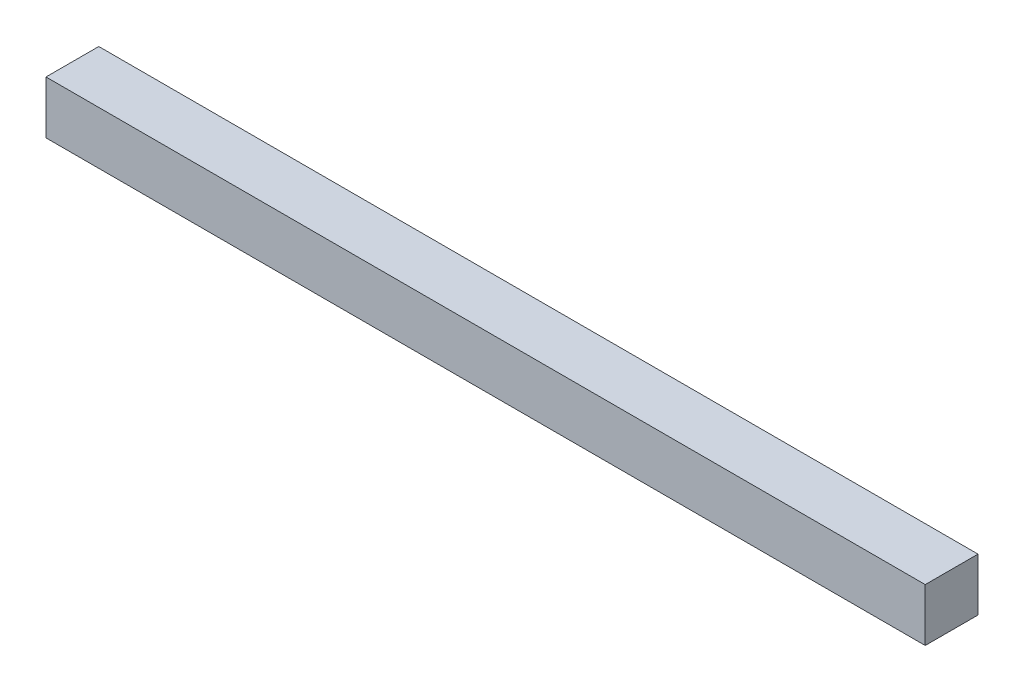
ISO-10303-21;
HEADER;
FILE_DESCRIPTION(('STEP AP214'),'2;1');
FILE_NAME('part.step','',(''),(''),'','','');
FILE_SCHEMA(('AUTOMOTIVE_DESIGN { 1 0 10303 214 1 1 1 1 }'));
ENDSEC;
DATA;
#1=APPLICATION_CONTEXT('core data for automotive mechanical design processes');
#2=APPLICATION_PROTOCOL_DEFINITION('international standard','automotive_design',2000,#1);
#3=PRODUCT_CONTEXT('',#1,'mechanical');
#4=PRODUCT('Part','Part','',(#3));
#5=PRODUCT_RELATED_PRODUCT_CATEGORY('part','',(#4));
#6=PRODUCT_DEFINITION_FORMATION('','',#4);
#7=PRODUCT_DEFINITION_CONTEXT('part definition',#1,'design');
#8=PRODUCT_DEFINITION('design','',#6,#7);
#9=PRODUCT_DEFINITION_SHAPE('','',#8);
#10=(LENGTH_UNIT() NAMED_UNIT(*) SI_UNIT(.MILLI.,.METRE.));
#11=(NAMED_UNIT(*) PLANE_ANGLE_UNIT() SI_UNIT($,.RADIAN.));
#12=(NAMED_UNIT(*) SI_UNIT($,.STERADIAN.) SOLID_ANGLE_UNIT());
#13=UNCERTAINTY_MEASURE_WITH_UNIT(LENGTH_MEASURE(1.E-05),#10,'distance_accuracy_value','');
#14=(GEOMETRIC_REPRESENTATION_CONTEXT(3) GLOBAL_UNCERTAINTY_ASSIGNED_CONTEXT((#13)) GLOBAL_UNIT_ASSIGNED_CONTEXT((#10,
#11,#12)) REPRESENTATION_CONTEXT('',''));
#15=CARTESIAN_POINT('',(0.,0.,0.));
#16=DIRECTION('',(0.,0.,1.));
#17=DIRECTION('',(1.,0.,0.));
#18=AXIS2_PLACEMENT_3D('',#15,#16,#17);
#19=CARTESIAN_POINT('',(423.164,0.,0.));
#20=DIRECTION('',(0.,0.,-1.));
#21=DIRECTION('',(-1.,0.,0.));
#22=AXIS2_PLACEMENT_3D('',#19,#20,#21);
#23=PLANE('',#22);
#24=DIRECTION('',(0.,-1.,0.));
#25=VECTOR('',#24,1.);
#26=CARTESIAN_POINT('',(0.,0.,0.));
#27=LINE('',#26,#25);
#28=CARTESIAN_POINT('',(0.,25.4,0.));
#29=VERTEX_POINT('',#28);
#30=CARTESIAN_POINT('',(0.,0.,0.));
#31=VERTEX_POINT('',#30);
#32=EDGE_CURVE('E103',#29,#31,#27,.T.);
#33=ORIENTED_EDGE('',*,*,#32,.T.);
#34=DIRECTION('',(-1.,0.,0.));
#35=VECTOR('',#34,1.);
#36=CARTESIAN_POINT('',(423.164,0.,0.));
#37=LINE('',#36,#35);
#38=CARTESIAN_POINT('',(423.164,0.,0.));
#39=VERTEX_POINT('',#38);
#40=EDGE_CURVE('E11',#39,#31,#37,.T.);
#41=ORIENTED_EDGE('',*,*,#40,.F.);
#42=DIRECTION('',(0.,-1.,0.));
#43=VECTOR('',#42,1.);
#44=CARTESIAN_POINT('',(423.164,0.,0.));
#45=LINE('',#44,#43);
#46=CARTESIAN_POINT('',(423.164,25.4,0.));
#47=VERTEX_POINT('',#46);
#48=EDGE_CURVE('E91',#47,#39,#45,.T.);
#49=ORIENTED_EDGE('',*,*,#48,.F.);
#50=DIRECTION('',(-1.,0.,0.));
#51=VECTOR('',#50,1.);
#52=CARTESIAN_POINT('',(423.164,25.4,0.));
#53=LINE('',#52,#51);
#54=EDGE_CURVE('E99',#47,#29,#53,.T.);
#55=ORIENTED_EDGE('',*,*,#54,.T.);
#56=EDGE_LOOP('',(#33,#41,#49,#55));
#57=FACE_BOUND('',#56,.T.);
#58=ADVANCED_FACE('F40',(#57),#23,.F.);
#59=CARTESIAN_POINT('',(423.164,0.,0.));
#60=DIRECTION('',(0.,1.,0.));
#61=DIRECTION('',(0.,0.,1.));
#62=AXIS2_PLACEMENT_3D('',#59,#60,#61);
#63=PLANE('',#62);
#64=DIRECTION('',(0.,0.,-1.));
#65=VECTOR('',#64,1.);
#66=CARTESIAN_POINT('',(0.,0.,0.));
#67=LINE('',#66,#65);
#68=CARTESIAN_POINT('',(0.,0.,-25.4));
#69=VERTEX_POINT('',#68);
#70=EDGE_CURVE('E95',#31,#69,#67,.T.);
#71=ORIENTED_EDGE('',*,*,#70,.T.);
#72=DIRECTION('',(-1.,0.,0.));
#73=VECTOR('',#72,1.);
#74=CARTESIAN_POINT('',(423.164,0.,-25.4));
#75=LINE('',#74,#73);
#76=CARTESIAN_POINT('',(423.164,0.,-25.4));
#77=VERTEX_POINT('',#76);
#78=EDGE_CURVE('E48',#77,#69,#75,.T.);
#79=ORIENTED_EDGE('',*,*,#78,.F.);
#80=DIRECTION('',(0.,0.,-1.));
#81=VECTOR('',#80,1.);
#82=CARTESIAN_POINT('',(423.164,0.,0.));
#83=LINE('',#82,#81);
#84=EDGE_CURVE('E86',#39,#77,#83,.T.);
#85=ORIENTED_EDGE('',*,*,#84,.F.);
#86=ORIENTED_EDGE('',*,*,#40,.T.);
#87=EDGE_LOOP('',(#71,#79,#85,#86));
#88=FACE_BOUND('',#87,.T.);
#89=ADVANCED_FACE('F94',(#88),#63,.F.);
#90=CARTESIAN_POINT('',(423.164,0.,-25.4));
#91=DIRECTION('',(0.,0.,1.));
#92=DIRECTION('',(1.,0.,0.));
#93=AXIS2_PLACEMENT_3D('',#90,#91,#92);
#94=PLANE('',#93);
#95=DIRECTION('',(0.,1.,0.));
#96=VECTOR('',#95,1.);
#97=CARTESIAN_POINT('',(0.,0.,-25.4));
#98=LINE('',#97,#96);
#99=CARTESIAN_POINT('',(0.,25.4,-25.4));
#100=VERTEX_POINT('',#99);
#101=EDGE_CURVE('E73',#69,#100,#98,.T.);
#102=ORIENTED_EDGE('',*,*,#101,.T.);
#103=DIRECTION('',(-1.,0.,0.));
#104=VECTOR('',#103,1.);
#105=CARTESIAN_POINT('',(423.164,25.4,-25.4));
#106=LINE('',#105,#104);
#107=CARTESIAN_POINT('',(423.164,25.4,-25.4));
#108=VERTEX_POINT('',#107);
#109=EDGE_CURVE('E96',#108,#100,#106,.T.);
#110=ORIENTED_EDGE('',*,*,#109,.F.);
#111=DIRECTION('',(0.,1.,0.));
#112=VECTOR('',#111,1.);
#113=CARTESIAN_POINT('',(423.164,0.,-25.4));
#114=LINE('',#113,#112);
#115=EDGE_CURVE('E89',#77,#108,#114,.T.);
#116=ORIENTED_EDGE('',*,*,#115,.F.);
#117=ORIENTED_EDGE('',*,*,#78,.T.);
#118=EDGE_LOOP('',(#102,#110,#116,#117));
#119=FACE_BOUND('',#118,.T.);
#120=ADVANCED_FACE('F97',(#119),#94,.F.);
#121=CARTESIAN_POINT('',(423.164,25.4,0.));
#122=DIRECTION('',(0.,-1.,0.));
#123=DIRECTION('',(0.,0.,-1.));
#124=AXIS2_PLACEMENT_3D('',#121,#122,#123);
#125=PLANE('',#124);
#126=DIRECTION('',(0.,0.,1.));
#127=VECTOR('',#126,1.);
#128=CARTESIAN_POINT('',(0.,25.4,0.));
#129=LINE('',#128,#127);
#130=EDGE_CURVE('E79',#100,#29,#129,.T.);
#131=ORIENTED_EDGE('',*,*,#130,.T.);
#132=ORIENTED_EDGE('',*,*,#54,.F.);
#133=DIRECTION('',(0.,0.,1.));
#134=VECTOR('',#133,1.);
#135=CARTESIAN_POINT('',(423.164,25.4,0.));
#136=LINE('',#135,#134);
#137=EDGE_CURVE('E56',#108,#47,#136,.T.);
#138=ORIENTED_EDGE('',*,*,#137,.F.);
#139=ORIENTED_EDGE('',*,*,#109,.T.);
#140=EDGE_LOOP('',(#131,#132,#138,#139));
#141=FACE_BOUND('',#140,.T.);
#142=ADVANCED_FACE('F110',(#141),#125,.F.);
#143=CARTESIAN_POINT('',(423.164,0.,0.));
#144=DIRECTION('',(-1.,0.,0.));
#145=DIRECTION('',(0.,0.,1.));
#146=AXIS2_PLACEMENT_3D('',#143,#144,#145);
#147=PLANE('',#146);
#148=ORIENTED_EDGE('',*,*,#48,.T.);
#149=ORIENTED_EDGE('',*,*,#84,.T.);
#150=ORIENTED_EDGE('',*,*,#115,.T.);
#151=ORIENTED_EDGE('',*,*,#137,.T.);
#152=EDGE_LOOP('',(#148,#149,#150,#151));
#153=FACE_BOUND('',#152,.T.);
#154=ADVANCED_FACE('F87',(#153),#147,.F.);
#155=CARTESIAN_POINT('',(0.,0.,0.));
#156=DIRECTION('',(-1.,0.,0.));
#157=DIRECTION('',(0.,0.,1.));
#158=AXIS2_PLACEMENT_3D('',#155,#156,#157);
#159=PLANE('',#158);
#160=ORIENTED_EDGE('',*,*,#32,.F.);
#161=ORIENTED_EDGE('',*,*,#130,.F.);
#162=ORIENTED_EDGE('',*,*,#101,.F.);
#163=ORIENTED_EDGE('',*,*,#70,.F.);
#164=EDGE_LOOP('',(#160,#161,#162,#163));
#165=FACE_BOUND('',#164,.T.);
#166=ADVANCED_FACE('F113',(#165),#159,.T.);
#167=CLOSED_SHELL('',(#58,#89,#120,#142,#154,#166));
#168=MANIFOLD_SOLID_BREP('B2',#167);
#169=ADVANCED_BREP_SHAPE_REPRESENTATION('',(#18,#168),#14);
#170=SHAPE_DEFINITION_REPRESENTATION(#9,#169);
ENDSEC;
END-ISO-10303-21;
